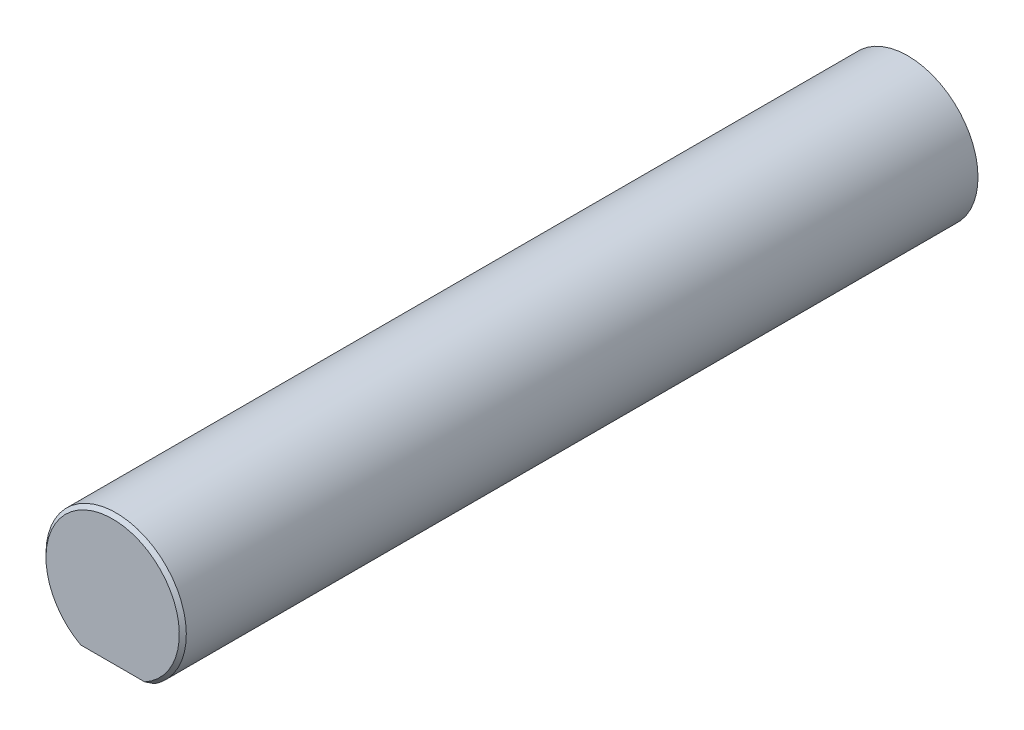
ISO-10303-21;
HEADER;
FILE_DESCRIPTION(('STEP AP214'),'2;1');
FILE_NAME('part.step','',(''),(''),'','','');
FILE_SCHEMA(('AUTOMOTIVE_DESIGN { 1 0 10303 214 1 1 1 1 }'));
ENDSEC;
DATA;
#1=APPLICATION_CONTEXT('core data for automotive mechanical design processes');
#2=APPLICATION_PROTOCOL_DEFINITION('international standard','automotive_design',2000,#1);
#3=PRODUCT_CONTEXT('',#1,'mechanical');
#4=PRODUCT('Part','Part','',(#3));
#5=PRODUCT_RELATED_PRODUCT_CATEGORY('part','',(#4));
#6=PRODUCT_DEFINITION_FORMATION('','',#4);
#7=PRODUCT_DEFINITION_CONTEXT('part definition',#1,'design');
#8=PRODUCT_DEFINITION('design','',#6,#7);
#9=PRODUCT_DEFINITION_SHAPE('','',#8);
#10=(LENGTH_UNIT() NAMED_UNIT(*) SI_UNIT(.MILLI.,.METRE.));
#11=(NAMED_UNIT(*) PLANE_ANGLE_UNIT() SI_UNIT($,.RADIAN.));
#12=(NAMED_UNIT(*) SI_UNIT($,.STERADIAN.) SOLID_ANGLE_UNIT());
#13=UNCERTAINTY_MEASURE_WITH_UNIT(LENGTH_MEASURE(1.E-05),#10,'distance_accuracy_value','');
#14=(GEOMETRIC_REPRESENTATION_CONTEXT(3) GLOBAL_UNCERTAINTY_ASSIGNED_CONTEXT((#13)) GLOBAL_UNIT_ASSIGNED_CONTEXT((#10,
#11,#12)) REPRESENTATION_CONTEXT('',''));
#15=CARTESIAN_POINT('',(0.,0.,0.));
#16=DIRECTION('',(0.,0.,1.));
#17=DIRECTION('',(1.,0.,0.));
#18=AXIS2_PLACEMENT_3D('',#15,#16,#17);
#19=CARTESIAN_POINT('',(0.,0.,22.));
#20=DIRECTION('',(0.,0.,-1.));
#21=DIRECTION('',(-1.,0.,0.));
#22=AXIS2_PLACEMENT_3D('',#19,#20,#21);
#23=CYLINDRICAL_SURFACE('',#22,3.);
#24=DIRECTION('',(0.,0.,-1.));
#25=VECTOR('',#24,1.);
#26=CARTESIAN_POINT('',(-1.6583123951777,-2.5,34.));
#27=LINE('',#26,#25);
#28=CARTESIAN_POINT('',(-1.6583123951777,-2.5,33.85));
#29=VERTEX_POINT('',#28);
#30=CARTESIAN_POINT('',(-1.6583123951777,-2.5,22.));
#31=VERTEX_POINT('',#30);
#32=EDGE_CURVE('E72',#29,#31,#27,.T.);
#33=ORIENTED_EDGE('',*,*,#32,.F.);
#34=CARTESIAN_POINT('',(0.,0.,33.85));
#35=DIRECTION('',(0.,0.,1.));
#36=DIRECTION('',(1.,0.,0.));
#37=AXIS2_PLACEMENT_3D('',#34,#35,#36);
#38=CIRCLE('',#37,3.);
#39=CARTESIAN_POINT('',(1.6583123951777,-2.5,33.85));
#40=VERTEX_POINT('',#39);
#41=EDGE_CURVE('E11',#29,#40,#38,.F.);
#42=ORIENTED_EDGE('',*,*,#41,.T.);
#43=DIRECTION('',(0.,0.,-1.));
#44=VECTOR('',#43,1.);
#45=CARTESIAN_POINT('',(1.6583123951777,-2.5,34.));
#46=LINE('',#45,#44);
#47=CARTESIAN_POINT('',(1.6583123951777,-2.5,22.));
#48=VERTEX_POINT('',#47);
#49=EDGE_CURVE('E66',#40,#48,#46,.T.);
#50=ORIENTED_EDGE('',*,*,#49,.T.);
#51=CARTESIAN_POINT('',(0.,0.,22.));
#52=DIRECTION('',(0.,0.,1.));
#53=DIRECTION('',(1.,0.,0.));
#54=AXIS2_PLACEMENT_3D('',#51,#52,#53);
#55=CIRCLE('',#54,3.);
#56=EDGE_CURVE('E69',#31,#48,#55,.T.);
#57=ORIENTED_EDGE('',*,*,#56,.F.);
#58=EDGE_LOOP('',(#33,#42,#50,#57));
#59=FACE_BOUND('',#58,.T.);
#60=CARTESIAN_POINT('',(0.,0.,0.));
#61=DIRECTION('',(0.,0.,1.));
#62=DIRECTION('',(1.,0.,0.));
#63=AXIS2_PLACEMENT_3D('',#60,#61,#62);
#64=CIRCLE('',#63,3.);
#65=CARTESIAN_POINT('',(3.,0.,0.));
#66=VERTEX_POINT('',#65);
#67=EDGE_CURVE('E80',#66,#66,#64,.T.);
#68=ORIENTED_EDGE('',*,*,#67,.T.);
#69=EDGE_LOOP('',(#68));
#70=FACE_BOUND('',#69,.T.);
#71=ADVANCED_FACE('F35',(#59,#70),#23,.T.);
#72=CARTESIAN_POINT('',(0.,0.,22.));
#73=DIRECTION('',(0.,0.,1.));
#74=DIRECTION('',(1.,0.,0.));
#75=AXIS2_PLACEMENT_3D('',#72,#73,#74);
#76=PLANE('',#75);
#77=DIRECTION('',(1.,0.,0.));
#78=VECTOR('',#77,1.);
#79=CARTESIAN_POINT('',(0.,-2.5,22.));
#80=LINE('',#79,#78);
#81=EDGE_CURVE('E78',#31,#48,#80,.T.);
#82=ORIENTED_EDGE('',*,*,#81,.F.);
#83=ORIENTED_EDGE('',*,*,#56,.T.);
#84=EDGE_LOOP('',(#82,#83));
#85=FACE_BOUND('',#84,.T.);
#86=ADVANCED_FACE('F77',(#85),#76,.T.);
#87=CARTESIAN_POINT('',(0.,0.,0.));
#88=DIRECTION('',(0.,0.,1.));
#89=DIRECTION('',(1.,0.,0.));
#90=AXIS2_PLACEMENT_3D('',#87,#88,#89);
#91=PLANE('',#90);
#92=ORIENTED_EDGE('',*,*,#67,.F.);
#93=EDGE_LOOP('',(#92));
#94=FACE_BOUND('',#93,.T.);
#95=ADVANCED_FACE('F116',(#94),#91,.F.);
#96=CARTESIAN_POINT('',(0.,-2.5,34.));
#97=DIRECTION('',(0.,1.,0.));
#98=DIRECTION('',(0.,0.,1.));
#99=AXIS2_PLACEMENT_3D('',#96,#97,#98);
#100=PLANE('',#99);
#101=DIRECTION('',(1.,0.,0.));
#102=VECTOR('',#101,1.);
#103=CARTESIAN_POINT('',(0.,-2.5,34.));
#104=LINE('',#103,#102);
#105=CARTESIAN_POINT('',(-1.36839321834042,-2.5,34.));
#106=VERTEX_POINT('',#105);
#107=CARTESIAN_POINT('',(1.36839321834042,-2.5,34.));
#108=VERTEX_POINT('',#107);
#109=EDGE_CURVE('E73',#106,#108,#104,.T.);
#110=ORIENTED_EDGE('',*,*,#109,.F.);
#111=CARTESIAN_POINT('',(-1.36839321834042,-2.5,34.));
#112=CARTESIAN_POINT('',(-1.39292139119499,-2.5,33.9882228379253));
#113=CARTESIAN_POINT('',(-1.41735432901618,-2.5,33.976248261613));
#114=CARTESIAN_POINT('',(-1.46603044356005,-2.5,33.9519315968654));
#115=CARTESIAN_POINT('',(-1.49027365816564,-2.5,33.9395895842912));
#116=CARTESIAN_POINT('',(-1.53858068516873,-2.5,33.9145607227099));
#117=CARTESIAN_POINT('',(-1.5626445005625,-2.5,33.9018738794786));
#118=CARTESIAN_POINT('',(-1.6106041710289,-2.5,33.8761748263009));
#119=CARTESIAN_POINT('',(-1.63449999064522,-2.5,33.8631625501639));
#120=CARTESIAN_POINT('',(-1.65831239517773,-2.5,33.8500000000001));
#121=B_SPLINE_CURVE_WITH_KNOTS('',3,(#111,#112,#113,#114,#115,#116,#117,#118,#119,#120),
.UNSPECIFIED.,.F.,.F.,(4,2,2,2,4),(0.,0.0816257102975864,0.163234683382849,0.244842290393531,
0.326466633006192),.UNSPECIFIED.);
#122=EDGE_CURVE('E44',#106,#29,#121,.T.);
#123=ORIENTED_EDGE('',*,*,#122,.T.);
#124=ORIENTED_EDGE('',*,*,#32,.T.);
#125=ORIENTED_EDGE('',*,*,#81,.T.);
#126=ORIENTED_EDGE('',*,*,#49,.F.);
#127=CARTESIAN_POINT('',(1.6583123951777,-2.5,33.85));
#128=CARTESIAN_POINT('',(1.6344999906452,-2.5,33.8631625501638));
#129=CARTESIAN_POINT('',(1.6106041710289,-2.5,33.8761748263009));
#130=CARTESIAN_POINT('',(1.56264450056251,-2.5,33.9018738794786));
#131=CARTESIAN_POINT('',(1.53858068516874,-2.5,33.9145607227099));
#132=CARTESIAN_POINT('',(1.49027365816564,-2.5,33.9395895842912));
#133=CARTESIAN_POINT('',(1.46603044356004,-2.5,33.9519315968653));
#134=CARTESIAN_POINT('',(1.41735432901619,-2.5,33.976248261613));
#135=CARTESIAN_POINT('',(1.39292139119503,-2.5,33.9882228379253));
#136=CARTESIAN_POINT('',(1.36839321834049,-2.5,34.0000000000001));
#137=B_SPLINE_CURVE_WITH_KNOTS('',3,(#127,#128,#129,#130,#131,#132,#133,#134,#135,#136),
.UNSPECIFIED.,.F.,.F.,(4,2,2,2,4),(0.,0.0816243426126644,0.163231949623342,0.244840922708601,
0.326466633006186),.UNSPECIFIED.);
#138=EDGE_CURVE('E99',#40,#108,#137,.T.);
#139=ORIENTED_EDGE('',*,*,#138,.T.);
#140=EDGE_LOOP('',(#110,#123,#124,#125,#126,#139));
#141=FACE_BOUND('',#140,.T.);
#142=ADVANCED_FACE('F82',(#141),#100,.F.);
#143=CARTESIAN_POINT('',(0.,0.,34.));
#144=DIRECTION('',(0.,0.,1.));
#145=DIRECTION('',(1.,0.,0.));
#146=AXIS2_PLACEMENT_3D('',#143,#144,#145);
#147=PLANE('',#146);
#148=ORIENTED_EDGE('',*,*,#109,.T.);
#149=CARTESIAN_POINT('',(0.,0.,34.));
#150=DIRECTION('',(0.,0.,1.));
#151=DIRECTION('',(1.,0.,0.));
#152=AXIS2_PLACEMENT_3D('',#149,#150,#151);
#153=CIRCLE('',#152,2.85000000000001);
#154=EDGE_CURVE('E79',#108,#106,#153,.T.);
#155=ORIENTED_EDGE('',*,*,#154,.T.);
#156=EDGE_LOOP('',(#148,#155));
#157=FACE_BOUND('',#156,.T.);
#158=ADVANCED_FACE('F115',(#157),#147,.T.);
#159=CARTESIAN_POINT('',(0.,0.,34.));
#160=DIRECTION('',(0.,0.,-1.));
#161=DIRECTION('',(-1.,0.,0.));
#162=AXIS2_PLACEMENT_3D('',#159,#160,#161);
#163=CONICAL_SURFACE('',#162,2.85000000000001,0.785398163397453);
#164=ORIENTED_EDGE('',*,*,#138,.F.);
#165=ORIENTED_EDGE('',*,*,#41,.F.);
#166=ORIENTED_EDGE('',*,*,#122,.F.);
#167=ORIENTED_EDGE('',*,*,#154,.F.);
#168=EDGE_LOOP('',(#164,#165,#166,#167));
#169=FACE_BOUND('',#168,.T.);
#170=ADVANCED_FACE('F37',(#169),#163,.T.);
#171=CLOSED_SHELL('',(#71,#86,#95,#142,#158,#170));
#172=MANIFOLD_SOLID_BREP('B2',#171);
#173=ADVANCED_BREP_SHAPE_REPRESENTATION('',(#18,#172),#14);
#174=SHAPE_DEFINITION_REPRESENTATION(#9,#173);
ENDSEC;
END-ISO-10303-21;
